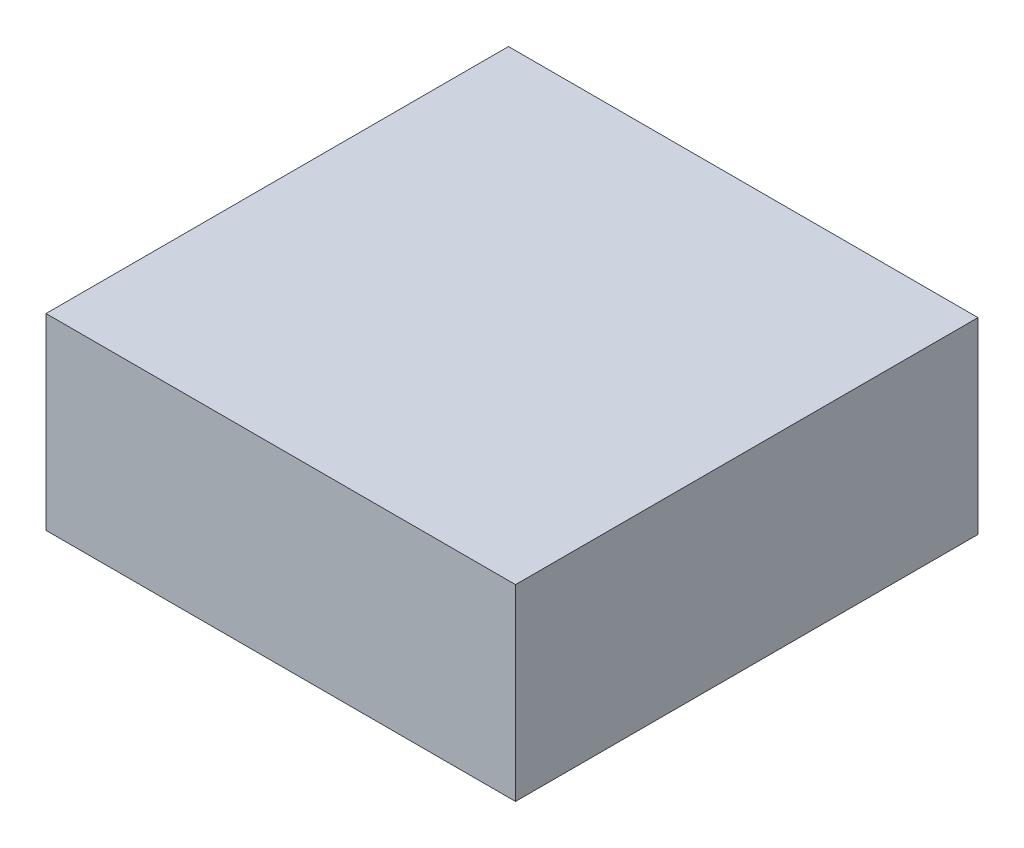
ISO-10303-21;
HEADER;
FILE_DESCRIPTION(('STEP AP214'),'2;1');
FILE_NAME('part.step','',(''),(''),'','','');
FILE_SCHEMA(('AUTOMOTIVE_DESIGN { 1 0 10303 214 1 1 1 1 }'));
ENDSEC;
DATA;
#1=APPLICATION_CONTEXT('core data for automotive mechanical design processes');
#2=APPLICATION_PROTOCOL_DEFINITION('international standard','automotive_design',2000,#1);
#3=PRODUCT_CONTEXT('',#1,'mechanical');
#4=PRODUCT('Part','Part','',(#3));
#5=PRODUCT_RELATED_PRODUCT_CATEGORY('part','',(#4));
#6=PRODUCT_DEFINITION_FORMATION('','',#4);
#7=PRODUCT_DEFINITION_CONTEXT('part definition',#1,'design');
#8=PRODUCT_DEFINITION('design','',#6,#7);
#9=PRODUCT_DEFINITION_SHAPE('','',#8);
#10=(LENGTH_UNIT() NAMED_UNIT(*) SI_UNIT(.MILLI.,.METRE.));
#11=(NAMED_UNIT(*) PLANE_ANGLE_UNIT() SI_UNIT($,.RADIAN.));
#12=(NAMED_UNIT(*) SI_UNIT($,.STERADIAN.) SOLID_ANGLE_UNIT());
#13=UNCERTAINTY_MEASURE_WITH_UNIT(LENGTH_MEASURE(1.E-05),#10,'distance_accuracy_value','');
#14=(GEOMETRIC_REPRESENTATION_CONTEXT(3) GLOBAL_UNCERTAINTY_ASSIGNED_CONTEXT((#13)) GLOBAL_UNIT_ASSIGNED_CONTEXT((#10,
#11,#12)) REPRESENTATION_CONTEXT('',''));
#15=CARTESIAN_POINT('',(0.,0.,0.));
#16=DIRECTION('',(0.,0.,1.));
#17=DIRECTION('',(1.,0.,0.));
#18=AXIS2_PLACEMENT_3D('',#15,#16,#17);
#19=CARTESIAN_POINT('',(0.,20.32,0.));
#20=DIRECTION('',(1.,0.,0.));
#21=DIRECTION('',(0.,0.,-1.));
#22=AXIS2_PLACEMENT_3D('',#19,#20,#21);
#23=PLANE('',#22);
#24=DIRECTION('',(0.,0.,1.));
#25=VECTOR('',#24,1.);
#26=CARTESIAN_POINT('',(0.,0.,0.));
#27=LINE('',#26,#25);
#28=CARTESIAN_POINT('',(0.,0.,-50.038));
#29=VERTEX_POINT('',#28);
#30=CARTESIAN_POINT('',(0.,0.,0.));
#31=VERTEX_POINT('',#30);
#32=EDGE_CURVE('E96',#29,#31,#27,.T.);
#33=ORIENTED_EDGE('',*,*,#32,.T.);
#34=DIRECTION('',(0.,-1.,0.));
#35=VECTOR('',#34,1.);
#36=CARTESIAN_POINT('',(0.,20.32,0.));
#37=LINE('',#36,#35);
#38=CARTESIAN_POINT('',(0.,20.32,0.));
#39=VERTEX_POINT('',#38);
#40=EDGE_CURVE('E11',#39,#31,#37,.T.);
#41=ORIENTED_EDGE('',*,*,#40,.F.);
#42=DIRECTION('',(0.,0.,1.));
#43=VECTOR('',#42,1.);
#44=CARTESIAN_POINT('',(0.,20.32,0.));
#45=LINE('',#44,#43);
#46=CARTESIAN_POINT('',(0.,20.32,-50.038));
#47=VERTEX_POINT('',#46);
#48=EDGE_CURVE('E84',#47,#39,#45,.T.);
#49=ORIENTED_EDGE('',*,*,#48,.F.);
#50=DIRECTION('',(0.,-1.,0.));
#51=VECTOR('',#50,1.);
#52=CARTESIAN_POINT('',(0.,20.32,-50.038));
#53=LINE('',#52,#51);
#54=EDGE_CURVE('E92',#47,#29,#53,.T.);
#55=ORIENTED_EDGE('',*,*,#54,.T.);
#56=EDGE_LOOP('',(#33,#41,#49,#55));
#57=FACE_BOUND('',#56,.T.);
#58=ADVANCED_FACE('F33',(#57),#23,.F.);
#59=CARTESIAN_POINT('',(0.,20.32,0.));
#60=DIRECTION('',(0.,0.,-1.));
#61=DIRECTION('',(-1.,0.,0.));
#62=AXIS2_PLACEMENT_3D('',#59,#60,#61);
#63=PLANE('',#62);
#64=DIRECTION('',(1.,0.,0.));
#65=VECTOR('',#64,1.);
#66=CARTESIAN_POINT('',(0.,0.,0.));
#67=LINE('',#66,#65);
#68=CARTESIAN_POINT('',(50.8,0.,0.));
#69=VERTEX_POINT('',#68);
#70=EDGE_CURVE('E88',#31,#69,#67,.T.);
#71=ORIENTED_EDGE('',*,*,#70,.T.);
#72=DIRECTION('',(0.,-1.,0.));
#73=VECTOR('',#72,1.);
#74=CARTESIAN_POINT('',(50.8,20.32,0.));
#75=LINE('',#74,#73);
#76=CARTESIAN_POINT('',(50.8,20.32,0.));
#77=VERTEX_POINT('',#76);
#78=EDGE_CURVE('E41',#77,#69,#75,.T.);
#79=ORIENTED_EDGE('',*,*,#78,.F.);
#80=DIRECTION('',(1.,0.,0.));
#81=VECTOR('',#80,1.);
#82=CARTESIAN_POINT('',(0.,20.32,0.));
#83=LINE('',#82,#81);
#84=EDGE_CURVE('E79',#39,#77,#83,.T.);
#85=ORIENTED_EDGE('',*,*,#84,.F.);
#86=ORIENTED_EDGE('',*,*,#40,.T.);
#87=EDGE_LOOP('',(#71,#79,#85,#86));
#88=FACE_BOUND('',#87,.T.);
#89=ADVANCED_FACE('F87',(#88),#63,.F.);
#90=CARTESIAN_POINT('',(50.8,20.32,0.));
#91=DIRECTION('',(-1.,0.,0.));
#92=DIRECTION('',(0.,0.,1.));
#93=AXIS2_PLACEMENT_3D('',#90,#91,#92);
#94=PLANE('',#93);
#95=DIRECTION('',(0.,0.,-1.));
#96=VECTOR('',#95,1.);
#97=CARTESIAN_POINT('',(50.8,0.,0.));
#98=LINE('',#97,#96);
#99=CARTESIAN_POINT('',(50.8,0.,-50.038));
#100=VERTEX_POINT('',#99);
#101=EDGE_CURVE('E66',#69,#100,#98,.T.);
#102=ORIENTED_EDGE('',*,*,#101,.T.);
#103=DIRECTION('',(0.,-1.,0.));
#104=VECTOR('',#103,1.);
#105=CARTESIAN_POINT('',(50.8,20.32,-50.038));
#106=LINE('',#105,#104);
#107=CARTESIAN_POINT('',(50.8,20.32,-50.038));
#108=VERTEX_POINT('',#107);
#109=EDGE_CURVE('E89',#108,#100,#106,.T.);
#110=ORIENTED_EDGE('',*,*,#109,.F.);
#111=DIRECTION('',(0.,0.,-1.));
#112=VECTOR('',#111,1.);
#113=CARTESIAN_POINT('',(50.8,20.32,0.));
#114=LINE('',#113,#112);
#115=EDGE_CURVE('E82',#77,#108,#114,.T.);
#116=ORIENTED_EDGE('',*,*,#115,.F.);
#117=ORIENTED_EDGE('',*,*,#78,.T.);
#118=EDGE_LOOP('',(#102,#110,#116,#117));
#119=FACE_BOUND('',#118,.T.);
#120=ADVANCED_FACE('F90',(#119),#94,.F.);
#121=CARTESIAN_POINT('',(0.,20.32,-50.038));
#122=DIRECTION('',(0.,0.,1.));
#123=DIRECTION('',(1.,0.,0.));
#124=AXIS2_PLACEMENT_3D('',#121,#122,#123);
#125=PLANE('',#124);
#126=DIRECTION('',(-1.,0.,0.));
#127=VECTOR('',#126,1.);
#128=CARTESIAN_POINT('',(0.,0.,-50.038));
#129=LINE('',#128,#127);
#130=EDGE_CURVE('E72',#100,#29,#129,.T.);
#131=ORIENTED_EDGE('',*,*,#130,.T.);
#132=ORIENTED_EDGE('',*,*,#54,.F.);
#133=DIRECTION('',(-1.,0.,0.));
#134=VECTOR('',#133,1.);
#135=CARTESIAN_POINT('',(0.,20.32,-50.038));
#136=LINE('',#135,#134);
#137=EDGE_CURVE('E49',#108,#47,#136,.T.);
#138=ORIENTED_EDGE('',*,*,#137,.F.);
#139=ORIENTED_EDGE('',*,*,#109,.T.);
#140=EDGE_LOOP('',(#131,#132,#138,#139));
#141=FACE_BOUND('',#140,.T.);
#142=ADVANCED_FACE('F103',(#141),#125,.F.);
#143=CARTESIAN_POINT('',(0.,20.32,0.));
#144=DIRECTION('',(0.,-1.,0.));
#145=DIRECTION('',(0.,0.,-1.));
#146=AXIS2_PLACEMENT_3D('',#143,#144,#145);
#147=PLANE('',#146);
#148=ORIENTED_EDGE('',*,*,#48,.T.);
#149=ORIENTED_EDGE('',*,*,#84,.T.);
#150=ORIENTED_EDGE('',*,*,#115,.T.);
#151=ORIENTED_EDGE('',*,*,#137,.T.);
#152=EDGE_LOOP('',(#148,#149,#150,#151));
#153=FACE_BOUND('',#152,.T.);
#154=ADVANCED_FACE('F80',(#153),#147,.F.);
#155=CARTESIAN_POINT('',(0.,0.,0.));
#156=DIRECTION('',(0.,-1.,0.));
#157=DIRECTION('',(0.,0.,-1.));
#158=AXIS2_PLACEMENT_3D('',#155,#156,#157);
#159=PLANE('',#158);
#160=ORIENTED_EDGE('',*,*,#32,.F.);
#161=ORIENTED_EDGE('',*,*,#130,.F.);
#162=ORIENTED_EDGE('',*,*,#101,.F.);
#163=ORIENTED_EDGE('',*,*,#70,.F.);
#164=EDGE_LOOP('',(#160,#161,#162,#163));
#165=FACE_BOUND('',#164,.T.);
#166=ADVANCED_FACE('F106',(#165),#159,.T.);
#167=CLOSED_SHELL('',(#58,#89,#120,#142,#154,#166));
#168=MANIFOLD_SOLID_BREP('B2',#167);
#169=ADVANCED_BREP_SHAPE_REPRESENTATION('',(#18,#168),#14);
#170=SHAPE_DEFINITION_REPRESENTATION(#9,#169);
ENDSEC;
END-ISO-10303-21;
